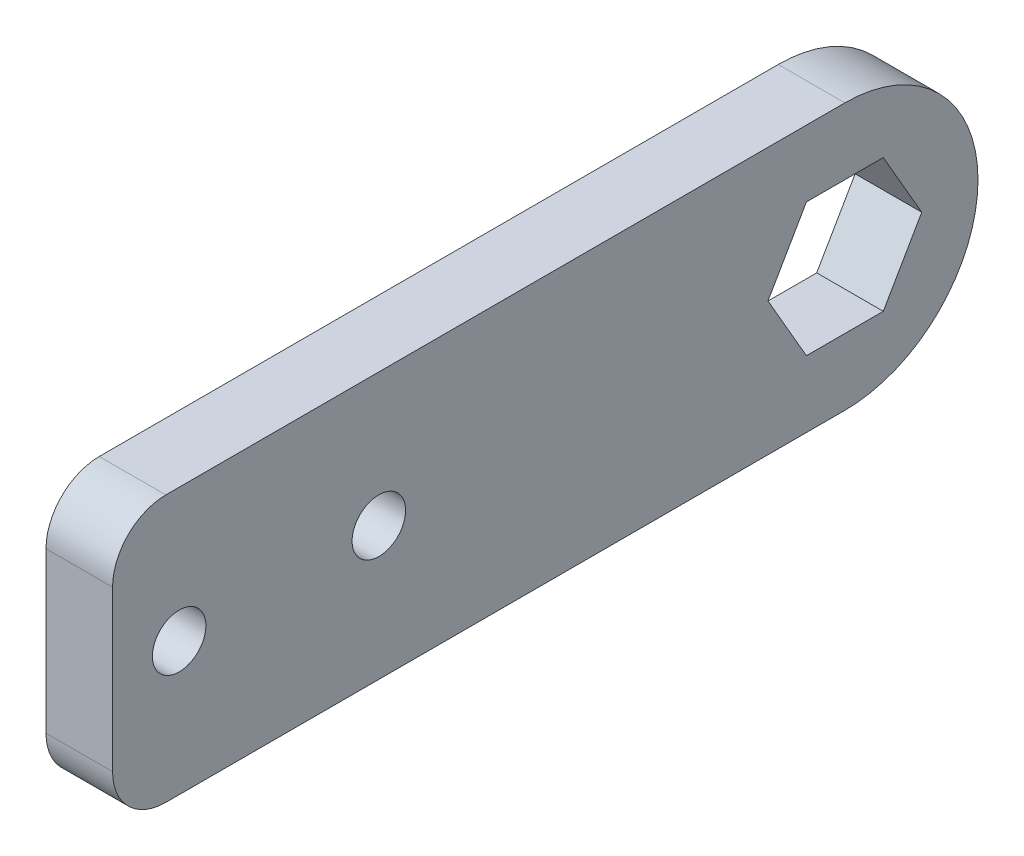
ISO-10303-21;
HEADER;
FILE_DESCRIPTION(('STEP AP214'),'2;1');
FILE_NAME('part.step','',(''),(''),'','','');
FILE_SCHEMA(('AUTOMOTIVE_DESIGN { 1 0 10303 214 1 1 1 1 }'));
ENDSEC;
DATA;
#1=APPLICATION_CONTEXT('core data for automotive mechanical design processes');
#2=APPLICATION_PROTOCOL_DEFINITION('international standard','automotive_design',2000,#1);
#3=PRODUCT_CONTEXT('',#1,'mechanical');
#4=PRODUCT('Part','Part','',(#3));
#5=PRODUCT_RELATED_PRODUCT_CATEGORY('part','',(#4));
#6=PRODUCT_DEFINITION_FORMATION('','',#4);
#7=PRODUCT_DEFINITION_CONTEXT('part definition',#1,'design');
#8=PRODUCT_DEFINITION('design','',#6,#7);
#9=PRODUCT_DEFINITION_SHAPE('','',#8);
#10=(LENGTH_UNIT() NAMED_UNIT(*) SI_UNIT(.MILLI.,.METRE.));
#11=(NAMED_UNIT(*) PLANE_ANGLE_UNIT() SI_UNIT($,.RADIAN.));
#12=(NAMED_UNIT(*) SI_UNIT($,.STERADIAN.) SOLID_ANGLE_UNIT());
#13=UNCERTAINTY_MEASURE_WITH_UNIT(LENGTH_MEASURE(1.E-05),#10,'distance_accuracy_value','');
#14=(GEOMETRIC_REPRESENTATION_CONTEXT(3) GLOBAL_UNCERTAINTY_ASSIGNED_CONTEXT((#13)) GLOBAL_UNIT_ASSIGNED_CONTEXT((#10,
#11,#12)) REPRESENTATION_CONTEXT('',''));
#15=CARTESIAN_POINT('',(0.,0.,0.));
#16=DIRECTION('',(0.,0.,1.));
#17=DIRECTION('',(1.,0.,0.));
#18=AXIS2_PLACEMENT_3D('',#15,#16,#17);
#19=CARTESIAN_POINT('',(3.175,12.7,41.275));
#20=DIRECTION('',(0.,-1.,0.));
#21=DIRECTION('',(0.,0.,-1.));
#22=AXIS2_PLACEMENT_3D('',#19,#20,#21);
#23=PLANE('',#22);
#24=DIRECTION('',(0.,0.,1.));
#25=VECTOR('',#24,1.);
#26=CARTESIAN_POINT('',(-3.175,12.7,41.275));
#27=LINE('',#26,#25);
#28=CARTESIAN_POINT('',(-3.175,12.7,-28.575));
#29=VERTEX_POINT('',#28);
#30=CARTESIAN_POINT('',(-3.175,12.7,36.195));
#31=VERTEX_POINT('',#30);
#32=EDGE_CURVE('E206',#29,#31,#27,.T.);
#33=ORIENTED_EDGE('',*,*,#32,.T.);
#34=DIRECTION('',(-1.,0.,0.));
#35=VECTOR('',#34,1.);
#36=CARTESIAN_POINT('',(3.175,12.7,36.195));
#37=LINE('',#36,#35);
#38=CARTESIAN_POINT('',(3.175,12.7,36.195));
#39=VERTEX_POINT('',#38);
#40=EDGE_CURVE('E11',#31,#39,#37,.F.);
#41=ORIENTED_EDGE('',*,*,#40,.T.);
#42=DIRECTION('',(0.,0.,1.));
#43=VECTOR('',#42,1.);
#44=CARTESIAN_POINT('',(3.175,12.7,41.275));
#45=LINE('',#44,#43);
#46=CARTESIAN_POINT('',(3.175,12.7,-28.575));
#47=VERTEX_POINT('',#46);
#48=EDGE_CURVE('E196',#47,#39,#45,.T.);
#49=ORIENTED_EDGE('',*,*,#48,.F.);
#50=DIRECTION('',(-1.,0.,0.));
#51=VECTOR('',#50,1.);
#52=CARTESIAN_POINT('',(3.175,12.7,-28.575));
#53=LINE('',#52,#51);
#54=EDGE_CURVE('E224',#47,#29,#53,.T.);
#55=ORIENTED_EDGE('',*,*,#54,.T.);
#56=EDGE_LOOP('',(#33,#41,#49,#55));
#57=FACE_BOUND('',#56,.T.);
#58=ADVANCED_FACE('F37',(#57),#23,.F.);
#59=CARTESIAN_POINT('',(3.175,-12.7,41.275));
#60=DIRECTION('',(0.,0.,-1.));
#61=DIRECTION('',(-1.,0.,0.));
#62=AXIS2_PLACEMENT_3D('',#59,#60,#61);
#63=PLANE('',#62);
#64=DIRECTION('',(0.,-1.,0.));
#65=VECTOR('',#64,1.);
#66=CARTESIAN_POINT('',(-3.175,-12.7,41.275));
#67=LINE('',#66,#65);
#68=CARTESIAN_POINT('',(-3.175,7.62,41.275));
#69=VERTEX_POINT('',#68);
#70=CARTESIAN_POINT('',(-3.175,-7.62,41.275));
#71=VERTEX_POINT('',#70);
#72=EDGE_CURVE('E209',#69,#71,#67,.T.);
#73=ORIENTED_EDGE('',*,*,#72,.T.);
#74=DIRECTION('',(-1.,0.,0.));
#75=VECTOR('',#74,1.);
#76=CARTESIAN_POINT('',(3.175,-7.62,41.275));
#77=LINE('',#76,#75);
#78=CARTESIAN_POINT('',(3.175,-7.62,41.275));
#79=VERTEX_POINT('',#78);
#80=EDGE_CURVE('E238',#71,#79,#77,.F.);
#81=ORIENTED_EDGE('',*,*,#80,.T.);
#82=DIRECTION('',(0.,-1.,0.));
#83=VECTOR('',#82,1.);
#84=CARTESIAN_POINT('',(3.175,-12.7,41.275));
#85=LINE('',#84,#83);
#86=CARTESIAN_POINT('',(3.175,7.62,41.275));
#87=VERTEX_POINT('',#86);
#88=EDGE_CURVE('E199',#87,#79,#85,.T.);
#89=ORIENTED_EDGE('',*,*,#88,.F.);
#90=DIRECTION('',(-1.,0.,0.));
#91=VECTOR('',#90,1.);
#92=CARTESIAN_POINT('',(3.175,7.62,41.275));
#93=LINE('',#92,#91);
#94=EDGE_CURVE('E235',#87,#69,#93,.T.);
#95=ORIENTED_EDGE('',*,*,#94,.T.);
#96=EDGE_LOOP('',(#73,#81,#89,#95));
#97=FACE_BOUND('',#96,.T.);
#98=ADVANCED_FACE('F258',(#97),#63,.F.);
#99=CARTESIAN_POINT('',(3.175,-12.7,41.275));
#100=DIRECTION('',(0.,1.,0.));
#101=DIRECTION('',(0.,0.,1.));
#102=AXIS2_PLACEMENT_3D('',#99,#100,#101);
#103=PLANE('',#102);
#104=DIRECTION('',(0.,0.,-1.));
#105=VECTOR('',#104,1.);
#106=CARTESIAN_POINT('',(3.175,-12.7,41.275));
#107=LINE('',#106,#105);
#108=CARTESIAN_POINT('',(3.175,-12.7,36.195));
#109=VERTEX_POINT('',#108);
#110=CARTESIAN_POINT('',(3.175,-12.7,-28.575));
#111=VERTEX_POINT('',#110);
#112=EDGE_CURVE('E203',#109,#111,#107,.T.);
#113=ORIENTED_EDGE('',*,*,#112,.F.);
#114=DIRECTION('',(-1.,0.,0.));
#115=VECTOR('',#114,1.);
#116=CARTESIAN_POINT('',(3.175,-12.7,36.195));
#117=LINE('',#116,#115);
#118=CARTESIAN_POINT('',(-3.175,-12.7,36.195));
#119=VERTEX_POINT('',#118);
#120=EDGE_CURVE('E226',#109,#119,#117,.T.);
#121=ORIENTED_EDGE('',*,*,#120,.T.);
#122=DIRECTION('',(0.,0.,-1.));
#123=VECTOR('',#122,1.);
#124=CARTESIAN_POINT('',(-3.175,-12.7,41.275));
#125=LINE('',#124,#123);
#126=CARTESIAN_POINT('',(-3.175,-12.7,-28.575));
#127=VERTEX_POINT('',#126);
#128=EDGE_CURVE('E200',#119,#127,#125,.T.);
#129=ORIENTED_EDGE('',*,*,#128,.T.);
#130=DIRECTION('',(-1.,0.,0.));
#131=VECTOR('',#130,1.);
#132=CARTESIAN_POINT('',(3.175,-12.7,-28.575));
#133=LINE('',#132,#131);
#134=EDGE_CURVE('E217',#127,#111,#133,.F.);
#135=ORIENTED_EDGE('',*,*,#134,.T.);
#136=EDGE_LOOP('',(#113,#121,#129,#135));
#137=FACE_BOUND('',#136,.T.);
#138=ADVANCED_FACE('F251',(#137),#103,.F.);
#139=CARTESIAN_POINT('',(3.175,0.,0.));
#140=DIRECTION('',(-1.,0.,0.));
#141=DIRECTION('',(0.,0.,1.));
#142=AXIS2_PLACEMENT_3D('',#139,#140,#141);
#143=PLANE('',#142);
#144=DIRECTION('',(0.,0.,1.));
#145=VECTOR('',#144,1.);
#146=CARTESIAN_POINT('',(3.175,6.35,-32.2411742093541));
#147=LINE('',#146,#145);
#148=CARTESIAN_POINT('',(3.175,6.35,-32.2411742093541));
#149=VERTEX_POINT('',#148);
#150=CARTESIAN_POINT('',(3.175,6.35,-24.9088257906459));
#151=VERTEX_POINT('',#150);
#152=EDGE_CURVE('E164',#149,#151,#147,.T.);
#153=ORIENTED_EDGE('',*,*,#152,.F.);
#154=DIRECTION('',(0.,0.866025403784438,0.5));
#155=VECTOR('',#154,1.);
#156=CARTESIAN_POINT('',(3.175,0.,-35.9073484187082));
#157=LINE('',#156,#155);
#158=CARTESIAN_POINT('',(3.175,0.,-35.9073484187082));
#159=VERTEX_POINT('',#158);
#160=EDGE_CURVE('E52',#159,#149,#157,.T.);
#161=ORIENTED_EDGE('',*,*,#160,.F.);
#162=DIRECTION('',(0.,0.866025403784439,-0.5));
#163=VECTOR('',#162,1.);
#164=CARTESIAN_POINT('',(3.175,-6.34999999999999,-32.2411742093541));
#165=LINE('',#164,#163);
#166=CARTESIAN_POINT('',(3.175,-6.34999999999999,-32.2411742093541));
#167=VERTEX_POINT('',#166);
#168=EDGE_CURVE('E150',#167,#159,#165,.T.);
#169=ORIENTED_EDGE('',*,*,#168,.F.);
#170=DIRECTION('',(0.,0.,-1.));
#171=VECTOR('',#170,1.);
#172=CARTESIAN_POINT('',(3.175,-6.34999999999999,-24.9088257906459));
#173=LINE('',#172,#171);
#174=CARTESIAN_POINT('',(3.175,-6.34999999999999,-24.9088257906459));
#175=VERTEX_POINT('',#174);
#176=EDGE_CURVE('E153',#175,#167,#173,.T.);
#177=ORIENTED_EDGE('',*,*,#176,.F.);
#178=DIRECTION('',(0.,-0.866025403784438,-0.5));
#179=VECTOR('',#178,1.);
#180=CARTESIAN_POINT('',(3.175,0.,-21.2426515812918));
#181=LINE('',#180,#179);
#182=CARTESIAN_POINT('',(3.175,0.,-21.2426515812918));
#183=VERTEX_POINT('',#182);
#184=EDGE_CURVE('E169',#183,#175,#181,.T.);
#185=ORIENTED_EDGE('',*,*,#184,.F.);
#186=DIRECTION('',(0.,-0.866025403784439,0.5));
#187=VECTOR('',#186,1.);
#188=CARTESIAN_POINT('',(3.175,6.35,-24.9088257906459));
#189=LINE('',#188,#187);
#190=EDGE_CURVE('E166',#151,#183,#189,.T.);
#191=ORIENTED_EDGE('',*,*,#190,.F.);
#192=EDGE_LOOP('',(#153,#161,#169,#177,#185,#191));
#193=FACE_BOUND('',#192,.T.);
#194=CARTESIAN_POINT('',(3.175,0.,15.875));
#195=DIRECTION('',(1.,0.,0.));
#196=DIRECTION('',(0.,0.,-1.));
#197=AXIS2_PLACEMENT_3D('',#194,#195,#196);
#198=CIRCLE('',#197,2.5527);
#199=CARTESIAN_POINT('',(3.175,0.,13.3223));
#200=VERTEX_POINT('',#199);
#201=EDGE_CURVE('E176',#200,#200,#198,.T.);
#202=ORIENTED_EDGE('',*,*,#201,.F.);
#203=EDGE_LOOP('',(#202));
#204=FACE_BOUND('',#203,.T.);
#205=CARTESIAN_POINT('',(3.175,0.,34.925));
#206=DIRECTION('',(1.,0.,0.));
#207=DIRECTION('',(0.,0.,-1.));
#208=AXIS2_PLACEMENT_3D('',#205,#206,#207);
#209=CIRCLE('',#208,2.5527);
#210=CARTESIAN_POINT('',(3.175,0.,32.3723));
#211=VERTEX_POINT('',#210);
#212=EDGE_CURVE('E189',#211,#211,#209,.T.);
#213=ORIENTED_EDGE('',*,*,#212,.F.);
#214=EDGE_LOOP('',(#213));
#215=FACE_BOUND('',#214,.T.);
#216=ORIENTED_EDGE('',*,*,#88,.T.);
#217=CARTESIAN_POINT('',(3.175,-7.62,36.195));
#218=DIRECTION('',(-1.,0.,0.));
#219=DIRECTION('',(0.,0.,1.));
#220=AXIS2_PLACEMENT_3D('',#217,#218,#219);
#221=CIRCLE('',#220,5.08);
#222=EDGE_CURVE('E45',#79,#109,#221,.F.);
#223=ORIENTED_EDGE('',*,*,#222,.T.);
#224=ORIENTED_EDGE('',*,*,#112,.T.);
#225=CARTESIAN_POINT('',(3.175,0.,-28.575));
#226=DIRECTION('',(-1.,0.,0.));
#227=DIRECTION('',(0.,0.,1.));
#228=AXIS2_PLACEMENT_3D('',#225,#226,#227);
#229=CIRCLE('',#228,12.7);
#230=CARTESIAN_POINT('',(3.175,0.,-41.275));
#231=VERTEX_POINT('',#230);
#232=EDGE_CURVE('E222',#111,#231,#229,.F.);
#233=ORIENTED_EDGE('',*,*,#232,.T.);
#234=CARTESIAN_POINT('',(3.175,0.,-28.575));
#235=DIRECTION('',(-1.,0.,0.));
#236=DIRECTION('',(0.,0.,1.));
#237=AXIS2_PLACEMENT_3D('',#234,#235,#236);
#238=CIRCLE('',#237,12.7);
#239=EDGE_CURVE('E220',#231,#47,#238,.F.);
#240=ORIENTED_EDGE('',*,*,#239,.T.);
#241=ORIENTED_EDGE('',*,*,#48,.T.);
#242=CARTESIAN_POINT('',(3.175,7.62,36.195));
#243=DIRECTION('',(-1.,0.,0.));
#244=DIRECTION('',(0.,0.,1.));
#245=AXIS2_PLACEMENT_3D('',#242,#243,#244);
#246=CIRCLE('',#245,5.08);
#247=EDGE_CURVE('E240',#39,#87,#246,.F.);
#248=ORIENTED_EDGE('',*,*,#247,.T.);
#249=EDGE_LOOP('',(#216,#223,#224,#233,#240,#241,#248));
#250=FACE_BOUND('',#249,.T.);
#251=ADVANCED_FACE('F244',(#193,#204,#215,#250),#143,.F.);
#252=CARTESIAN_POINT('',(-3.175,0.,0.));
#253=DIRECTION('',(-1.,0.,0.));
#254=DIRECTION('',(0.,0.,1.));
#255=AXIS2_PLACEMENT_3D('',#252,#253,#254);
#256=PLANE('',#255);
#257=DIRECTION('',(0.,0.866025403784438,0.5));
#258=VECTOR('',#257,1.);
#259=CARTESIAN_POINT('',(-3.175,0.,-35.9073484187082));
#260=LINE('',#259,#258);
#261=CARTESIAN_POINT('',(-3.175,0.,-35.9073484187082));
#262=VERTEX_POINT('',#261);
#263=CARTESIAN_POINT('',(-3.175,6.35,-32.2411742093541));
#264=VERTEX_POINT('',#263);
#265=EDGE_CURVE('E133',#262,#264,#260,.T.);
#266=ORIENTED_EDGE('',*,*,#265,.T.);
#267=DIRECTION('',(0.,0.,1.));
#268=VECTOR('',#267,1.);
#269=CARTESIAN_POINT('',(-3.175,6.35,-32.2411742093541));
#270=LINE('',#269,#268);
#271=CARTESIAN_POINT('',(-3.175,6.35,-24.9088257906459));
#272=VERTEX_POINT('',#271);
#273=EDGE_CURVE('E142',#264,#272,#270,.T.);
#274=ORIENTED_EDGE('',*,*,#273,.T.);
#275=DIRECTION('',(0.,-0.866025403784439,0.5));
#276=VECTOR('',#275,1.);
#277=CARTESIAN_POINT('',(-3.175,6.35,-24.9088257906459));
#278=LINE('',#277,#276);
#279=CARTESIAN_POINT('',(-3.175,0.,-21.2426515812918));
#280=VERTEX_POINT('',#279);
#281=EDGE_CURVE('E60',#272,#280,#278,.T.);
#282=ORIENTED_EDGE('',*,*,#281,.T.);
#283=DIRECTION('',(0.,-0.866025403784438,-0.5));
#284=VECTOR('',#283,1.);
#285=CARTESIAN_POINT('',(-3.175,0.,-21.2426515812918));
#286=LINE('',#285,#284);
#287=CARTESIAN_POINT('',(-3.175,-6.34999999999999,-24.9088257906459));
#288=VERTEX_POINT('',#287);
#289=EDGE_CURVE('E157',#280,#288,#286,.T.);
#290=ORIENTED_EDGE('',*,*,#289,.T.);
#291=DIRECTION('',(0.,0.,-1.));
#292=VECTOR('',#291,1.);
#293=CARTESIAN_POINT('',(-3.175,-6.34999999999999,-24.9088257906459));
#294=LINE('',#293,#292);
#295=CARTESIAN_POINT('',(-3.175,-6.34999999999999,-32.2411742093541));
#296=VERTEX_POINT('',#295);
#297=EDGE_CURVE('E160',#288,#296,#294,.T.);
#298=ORIENTED_EDGE('',*,*,#297,.T.);
#299=DIRECTION('',(0.,0.866025403784439,-0.5));
#300=VECTOR('',#299,1.);
#301=CARTESIAN_POINT('',(-3.175,-6.34999999999999,-32.2411742093541));
#302=LINE('',#301,#300);
#303=EDGE_CURVE('E139',#296,#262,#302,.T.);
#304=ORIENTED_EDGE('',*,*,#303,.T.);
#305=EDGE_LOOP('',(#266,#274,#282,#290,#298,#304));
#306=FACE_BOUND('',#305,.T.);
#307=CARTESIAN_POINT('',(-3.175,0.,15.875));
#308=DIRECTION('',(1.,0.,0.));
#309=DIRECTION('',(0.,0.,-1.));
#310=AXIS2_PLACEMENT_3D('',#307,#308,#309);
#311=CIRCLE('',#310,2.5527);
#312=CARTESIAN_POINT('',(-3.175,0.,13.3223));
#313=VERTEX_POINT('',#312);
#314=EDGE_CURVE('E186',#313,#313,#311,.T.);
#315=ORIENTED_EDGE('',*,*,#314,.T.);
#316=EDGE_LOOP('',(#315));
#317=FACE_BOUND('',#316,.T.);
#318=CARTESIAN_POINT('',(-3.175,0.,34.925));
#319=DIRECTION('',(1.,0.,0.));
#320=DIRECTION('',(0.,0.,-1.));
#321=AXIS2_PLACEMENT_3D('',#318,#319,#320);
#322=CIRCLE('',#321,2.5527);
#323=CARTESIAN_POINT('',(-3.175,0.,32.3723));
#324=VERTEX_POINT('',#323);
#325=EDGE_CURVE('E192',#324,#324,#322,.T.);
#326=ORIENTED_EDGE('',*,*,#325,.T.);
#327=EDGE_LOOP('',(#326));
#328=FACE_BOUND('',#327,.T.);
#329=ORIENTED_EDGE('',*,*,#128,.F.);
#330=CARTESIAN_POINT('',(-3.175,-7.62,36.195));
#331=DIRECTION('',(-1.,0.,0.));
#332=DIRECTION('',(0.,0.,1.));
#333=AXIS2_PLACEMENT_3D('',#330,#331,#332);
#334=CIRCLE('',#333,5.08);
#335=EDGE_CURVE('E233',#119,#71,#334,.T.);
#336=ORIENTED_EDGE('',*,*,#335,.T.);
#337=ORIENTED_EDGE('',*,*,#72,.F.);
#338=CARTESIAN_POINT('',(-3.175,7.62,36.195));
#339=DIRECTION('',(-1.,0.,0.));
#340=DIRECTION('',(0.,0.,1.));
#341=AXIS2_PLACEMENT_3D('',#338,#339,#340);
#342=CIRCLE('',#341,5.08);
#343=EDGE_CURVE('E231',#69,#31,#342,.T.);
#344=ORIENTED_EDGE('',*,*,#343,.T.);
#345=ORIENTED_EDGE('',*,*,#32,.F.);
#346=CARTESIAN_POINT('',(-3.175,0.,-28.575));
#347=DIRECTION('',(-1.,0.,0.));
#348=DIRECTION('',(0.,0.,1.));
#349=AXIS2_PLACEMENT_3D('',#346,#347,#348);
#350=CIRCLE('',#349,12.7);
#351=CARTESIAN_POINT('',(-3.175,0.,-41.275));
#352=VERTEX_POINT('',#351);
#353=EDGE_CURVE('E205',#29,#352,#350,.T.);
#354=ORIENTED_EDGE('',*,*,#353,.T.);
#355=CARTESIAN_POINT('',(-3.175,0.,-28.575));
#356=DIRECTION('',(-1.,0.,0.));
#357=DIRECTION('',(0.,0.,1.));
#358=AXIS2_PLACEMENT_3D('',#355,#356,#357);
#359=CIRCLE('',#358,12.7);
#360=EDGE_CURVE('E214',#352,#127,#359,.T.);
#361=ORIENTED_EDGE('',*,*,#360,.T.);
#362=EDGE_LOOP('',(#329,#336,#337,#344,#345,#354,#361));
#363=FACE_BOUND('',#362,.T.);
#364=ADVANCED_FACE('F146',(#306,#317,#328,#363),#256,.T.);
#365=CARTESIAN_POINT('',(3.175,0.,-28.575));
#366=DIRECTION('',(-1.,0.,0.));
#367=DIRECTION('',(0.,0.,1.));
#368=AXIS2_PLACEMENT_3D('',#365,#366,#367);
#369=CYLINDRICAL_SURFACE('',#368,12.7);
#370=ORIENTED_EDGE('',*,*,#54,.F.);
#371=ORIENTED_EDGE('',*,*,#239,.F.);
#372=DIRECTION('',(-1.,0.,0.));
#373=VECTOR('',#372,1.);
#374=CARTESIAN_POINT('',(3.175,0.,-41.275));
#375=LINE('',#374,#373);
#376=EDGE_CURVE('E195',#352,#231,#375,.F.);
#377=ORIENTED_EDGE('',*,*,#376,.F.);
#378=ORIENTED_EDGE('',*,*,#353,.F.);
#379=EDGE_LOOP('',(#370,#371,#377,#378));
#380=FACE_BOUND('',#379,.T.);
#381=ADVANCED_FACE('F270',(#380),#369,.T.);
#382=CARTESIAN_POINT('',(3.175,0.,-28.575));
#383=DIRECTION('',(-1.,0.,0.));
#384=DIRECTION('',(0.,0.,1.));
#385=AXIS2_PLACEMENT_3D('',#382,#383,#384);
#386=CYLINDRICAL_SURFACE('',#385,12.7);
#387=ORIENTED_EDGE('',*,*,#232,.F.);
#388=ORIENTED_EDGE('',*,*,#134,.F.);
#389=ORIENTED_EDGE('',*,*,#360,.F.);
#390=ORIENTED_EDGE('',*,*,#376,.T.);
#391=EDGE_LOOP('',(#387,#388,#389,#390));
#392=FACE_BOUND('',#391,.T.);
#393=ADVANCED_FACE('F274',(#392),#386,.T.);
#394=CARTESIAN_POINT('',(3.175,0.,34.925));
#395=DIRECTION('',(1.,0.,0.));
#396=DIRECTION('',(0.,0.,-1.));
#397=AXIS2_PLACEMENT_3D('',#394,#395,#396);
#398=CYLINDRICAL_SURFACE('',#397,2.5527);
#399=ORIENTED_EDGE('',*,*,#325,.F.);
#400=EDGE_LOOP('',(#399));
#401=FACE_BOUND('',#400,.T.);
#402=ORIENTED_EDGE('',*,*,#212,.T.);
#403=EDGE_LOOP('',(#402));
#404=FACE_BOUND('',#403,.T.);
#405=ADVANCED_FACE('F276',(#401,#404),#398,.F.);
#406=CARTESIAN_POINT('',(3.175,0.,15.875));
#407=DIRECTION('',(1.,0.,0.));
#408=DIRECTION('',(0.,0.,-1.));
#409=AXIS2_PLACEMENT_3D('',#406,#407,#408);
#410=CYLINDRICAL_SURFACE('',#409,2.5527);
#411=ORIENTED_EDGE('',*,*,#314,.F.);
#412=EDGE_LOOP('',(#411));
#413=FACE_BOUND('',#412,.T.);
#414=ORIENTED_EDGE('',*,*,#201,.T.);
#415=EDGE_LOOP('',(#414));
#416=FACE_BOUND('',#415,.T.);
#417=ADVANCED_FACE('F282',(#413,#416),#410,.F.);
#418=CARTESIAN_POINT('',(3.175,-7.62,36.195));
#419=DIRECTION('',(-1.,0.,0.));
#420=DIRECTION('',(0.,0.,1.));
#421=AXIS2_PLACEMENT_3D('',#418,#419,#420);
#422=CYLINDRICAL_SURFACE('',#421,5.08);
#423=ORIENTED_EDGE('',*,*,#222,.F.);
#424=ORIENTED_EDGE('',*,*,#80,.F.);
#425=ORIENTED_EDGE('',*,*,#335,.F.);
#426=ORIENTED_EDGE('',*,*,#120,.F.);
#427=EDGE_LOOP('',(#423,#424,#425,#426));
#428=FACE_BOUND('',#427,.T.);
#429=ADVANCED_FACE('F254',(#428),#422,.T.);
#430=CARTESIAN_POINT('',(3.175,7.62,36.195));
#431=DIRECTION('',(-1.,0.,0.));
#432=DIRECTION('',(0.,0.,1.));
#433=AXIS2_PLACEMENT_3D('',#430,#431,#432);
#434=CYLINDRICAL_SURFACE('',#433,5.08);
#435=ORIENTED_EDGE('',*,*,#247,.F.);
#436=ORIENTED_EDGE('',*,*,#40,.F.);
#437=ORIENTED_EDGE('',*,*,#343,.F.);
#438=ORIENTED_EDGE('',*,*,#94,.F.);
#439=EDGE_LOOP('',(#435,#436,#437,#438));
#440=FACE_BOUND('',#439,.T.);
#441=ADVANCED_FACE('F39',(#440),#434,.T.);
#442=CARTESIAN_POINT('',(-3.175,0.,-35.9073484187082));
#443=DIRECTION('',(0.,0.5,-0.866025403784439));
#444=DIRECTION('',(0.,0.866025403784439,0.5));
#445=AXIS2_PLACEMENT_3D('',#442,#443,#444);
#446=PLANE('',#445);
#447=ORIENTED_EDGE('',*,*,#160,.T.);
#448=DIRECTION('',(1.,0.,0.));
#449=VECTOR('',#448,1.);
#450=CARTESIAN_POINT('',(-3.175,6.35,-32.2411742093541));
#451=LINE('',#450,#449);
#452=EDGE_CURVE('E129',#264,#149,#451,.T.);
#453=ORIENTED_EDGE('',*,*,#452,.F.);
#454=ORIENTED_EDGE('',*,*,#265,.F.);
#455=DIRECTION('',(1.,0.,0.));
#456=VECTOR('',#455,1.);
#457=CARTESIAN_POINT('',(-3.175,0.,-35.9073484187082));
#458=LINE('',#457,#456);
#459=EDGE_CURVE('E174',#262,#159,#458,.T.);
#460=ORIENTED_EDGE('',*,*,#459,.T.);
#461=EDGE_LOOP('',(#447,#453,#454,#460));
#462=FACE_BOUND('',#461,.T.);
#463=ADVANCED_FACE('F131',(#462),#446,.F.);
#464=CARTESIAN_POINT('',(-3.175,-6.34999999999999,-32.2411742093541));
#465=DIRECTION('',(0.,-0.5,-0.866025403784439));
#466=DIRECTION('',(0.,0.866025403784439,-0.5));
#467=AXIS2_PLACEMENT_3D('',#464,#465,#466);
#468=PLANE('',#467);
#469=ORIENTED_EDGE('',*,*,#168,.T.);
#470=ORIENTED_EDGE('',*,*,#459,.F.);
#471=ORIENTED_EDGE('',*,*,#303,.F.);
#472=DIRECTION('',(1.,0.,0.));
#473=VECTOR('',#472,1.);
#474=CARTESIAN_POINT('',(-3.175,-6.34999999999999,-32.2411742093541));
#475=LINE('',#474,#473);
#476=EDGE_CURVE('E177',#296,#167,#475,.T.);
#477=ORIENTED_EDGE('',*,*,#476,.T.);
#478=EDGE_LOOP('',(#469,#470,#471,#477));
#479=FACE_BOUND('',#478,.T.);
#480=ADVANCED_FACE('F305',(#479),#468,.F.);
#481=CARTESIAN_POINT('',(-3.175,-6.34999999999999,-24.9088257906459));
#482=DIRECTION('',(0.,-1.,0.));
#483=DIRECTION('',(0.,0.,-1.));
#484=AXIS2_PLACEMENT_3D('',#481,#482,#483);
#485=PLANE('',#484);
#486=ORIENTED_EDGE('',*,*,#176,.T.);
#487=ORIENTED_EDGE('',*,*,#476,.F.);
#488=ORIENTED_EDGE('',*,*,#297,.F.);
#489=DIRECTION('',(1.,0.,0.));
#490=VECTOR('',#489,1.);
#491=CARTESIAN_POINT('',(-3.175,-6.34999999999999,-24.9088257906459));
#492=LINE('',#491,#490);
#493=EDGE_CURVE('E179',#288,#175,#492,.T.);
#494=ORIENTED_EDGE('',*,*,#493,.T.);
#495=EDGE_LOOP('',(#486,#487,#488,#494));
#496=FACE_BOUND('',#495,.T.);
#497=ADVANCED_FACE('F314',(#496),#485,.F.);
#498=CARTESIAN_POINT('',(-3.175,0.,-21.2426515812918));
#499=DIRECTION('',(0.,-0.5,0.866025403784438));
#500=DIRECTION('',(0.,-0.866025403784439,-0.5));
#501=AXIS2_PLACEMENT_3D('',#498,#499,#500);
#502=PLANE('',#501);
#503=ORIENTED_EDGE('',*,*,#184,.T.);
#504=ORIENTED_EDGE('',*,*,#493,.F.);
#505=ORIENTED_EDGE('',*,*,#289,.F.);
#506=DIRECTION('',(1.,0.,0.));
#507=VECTOR('',#506,1.);
#508=CARTESIAN_POINT('',(-3.175,0.,-21.2426515812918));
#509=LINE('',#508,#507);
#510=EDGE_CURVE('E181',#280,#183,#509,.T.);
#511=ORIENTED_EDGE('',*,*,#510,.T.);
#512=EDGE_LOOP('',(#503,#504,#505,#511));
#513=FACE_BOUND('',#512,.T.);
#514=ADVANCED_FACE('F311',(#513),#502,.F.);
#515=CARTESIAN_POINT('',(-3.175,6.35,-24.9088257906459));
#516=DIRECTION('',(0.,0.5,0.866025403784439));
#517=DIRECTION('',(0.,-0.866025403784439,0.5));
#518=AXIS2_PLACEMENT_3D('',#515,#516,#517);
#519=PLANE('',#518);
#520=ORIENTED_EDGE('',*,*,#190,.T.);
#521=ORIENTED_EDGE('',*,*,#510,.F.);
#522=ORIENTED_EDGE('',*,*,#281,.F.);
#523=DIRECTION('',(1.,0.,0.));
#524=VECTOR('',#523,1.);
#525=CARTESIAN_POINT('',(-3.175,6.35,-24.9088257906459));
#526=LINE('',#525,#524);
#527=EDGE_CURVE('E138',#272,#151,#526,.T.);
#528=ORIENTED_EDGE('',*,*,#527,.T.);
#529=EDGE_LOOP('',(#520,#521,#522,#528));
#530=FACE_BOUND('',#529,.T.);
#531=ADVANCED_FACE('F308',(#530),#519,.F.);
#532=CARTESIAN_POINT('',(-3.175,6.35,-32.2411742093541));
#533=DIRECTION('',(0.,1.,0.));
#534=DIRECTION('',(0.,0.,1.));
#535=AXIS2_PLACEMENT_3D('',#532,#533,#534);
#536=PLANE('',#535);
#537=ORIENTED_EDGE('',*,*,#152,.T.);
#538=ORIENTED_EDGE('',*,*,#527,.F.);
#539=ORIENTED_EDGE('',*,*,#273,.F.);
#540=ORIENTED_EDGE('',*,*,#452,.T.);
#541=EDGE_LOOP('',(#537,#538,#539,#540));
#542=FACE_BOUND('',#541,.T.);
#543=ADVANCED_FACE('F143',(#542),#536,.F.);
#544=CLOSED_SHELL('',(#58,#98,#138,#251,#364,#381,#393,#405,#417,#429,#441,#463,#480,#497,#514,
#531,#543));
#545=MANIFOLD_SOLID_BREP('B2',#544);
#546=ADVANCED_BREP_SHAPE_REPRESENTATION('',(#18,#545),#14);
#547=SHAPE_DEFINITION_REPRESENTATION(#9,#546);
ENDSEC;
END-ISO-10303-21;
